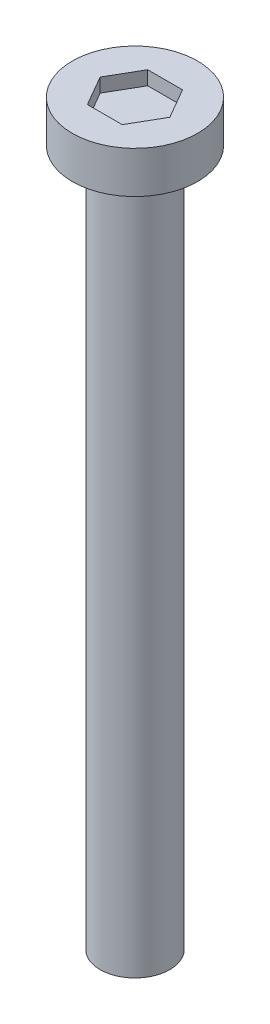
ISO-10303-21;
HEADER;
FILE_DESCRIPTION(('STEP AP214'),'2;1');
FILE_NAME('part.step','',(''),(''),'','','');
FILE_SCHEMA(('AUTOMOTIVE_DESIGN { 1 0 10303 214 1 1 1 1 }'));
ENDSEC;
DATA;
#1=APPLICATION_CONTEXT('core data for automotive mechanical design processes');
#2=APPLICATION_PROTOCOL_DEFINITION('international standard','automotive_design',2000,#1);
#3=PRODUCT_CONTEXT('',#1,'mechanical');
#4=PRODUCT('Part','Part','',(#3));
#5=PRODUCT_RELATED_PRODUCT_CATEGORY('part','',(#4));
#6=PRODUCT_DEFINITION_FORMATION('','',#4);
#7=PRODUCT_DEFINITION_CONTEXT('part definition',#1,'design');
#8=PRODUCT_DEFINITION('design','',#6,#7);
#9=PRODUCT_DEFINITION_SHAPE('','',#8);
#10=(LENGTH_UNIT() NAMED_UNIT(*) SI_UNIT(.MILLI.,.METRE.));
#11=(NAMED_UNIT(*) PLANE_ANGLE_UNIT() SI_UNIT($,.RADIAN.));
#12=(NAMED_UNIT(*) SI_UNIT($,.STERADIAN.) SOLID_ANGLE_UNIT());
#13=UNCERTAINTY_MEASURE_WITH_UNIT(LENGTH_MEASURE(1.E-05),#10,'distance_accuracy_value','');
#14=(GEOMETRIC_REPRESENTATION_CONTEXT(3) GLOBAL_UNCERTAINTY_ASSIGNED_CONTEXT((#13)) GLOBAL_UNIT_ASSIGNED_CONTEXT((#10,
#11,#12)) REPRESENTATION_CONTEXT('',''));
#15=CARTESIAN_POINT('',(0.,0.,0.));
#16=DIRECTION('',(0.,0.,1.));
#17=DIRECTION('',(1.,0.,0.));
#18=AXIS2_PLACEMENT_3D('',#15,#16,#17);
#19=CARTESIAN_POINT('',(0.,25.,0.));
#20=DIRECTION('',(0.,-1.,0.));
#21=DIRECTION('',(0.,0.,-1.));
#22=AXIS2_PLACEMENT_3D('',#19,#20,#21);
#23=CYLINDRICAL_SURFACE('',#22,1.25);
#24=CARTESIAN_POINT('',(0.,25.,0.));
#25=DIRECTION('',(0.,1.,0.));
#26=DIRECTION('',(0.,0.,1.));
#27=AXIS2_PLACEMENT_3D('',#24,#25,#26);
#28=CIRCLE('',#27,1.25);
#29=CARTESIAN_POINT('',(0.,25.,1.25));
#30=VERTEX_POINT('',#29);
#31=EDGE_CURVE('E11',#30,#30,#28,.T.);
#32=ORIENTED_EDGE('',*,*,#31,.F.);
#33=EDGE_LOOP('',(#32));
#34=FACE_BOUND('',#33,.T.);
#35=CARTESIAN_POINT('',(0.,0.,0.));
#36=DIRECTION('',(0.,1.,0.));
#37=DIRECTION('',(0.,0.,1.));
#38=AXIS2_PLACEMENT_3D('',#35,#36,#37);
#39=CIRCLE('',#38,1.25);
#40=CARTESIAN_POINT('',(0.,0.,1.25));
#41=VERTEX_POINT('',#40);
#42=EDGE_CURVE('E42',#41,#41,#39,.T.);
#43=ORIENTED_EDGE('',*,*,#42,.T.);
#44=EDGE_LOOP('',(#43));
#45=FACE_BOUND('',#44,.T.);
#46=ADVANCED_FACE('F39',(#34,#45),#23,.T.);
#47=CARTESIAN_POINT('',(0.,0.,0.));
#48=DIRECTION('',(0.,1.,0.));
#49=DIRECTION('',(0.,0.,1.));
#50=AXIS2_PLACEMENT_3D('',#47,#48,#49);
#51=PLANE('',#50);
#52=ORIENTED_EDGE('',*,*,#42,.F.);
#53=EDGE_LOOP('',(#52));
#54=FACE_BOUND('',#53,.T.);
#55=ADVANCED_FACE('F189',(#54),#51,.F.);
#56=CARTESIAN_POINT('',(0.,26.5,0.));
#57=DIRECTION('',(0.,-1.,0.));
#58=DIRECTION('',(0.,0.,-1.));
#59=AXIS2_PLACEMENT_3D('',#56,#57,#58);
#60=CYLINDRICAL_SURFACE('',#59,2.25);
#61=CARTESIAN_POINT('',(0.,26.5,0.));
#62=DIRECTION('',(0.,1.,0.));
#63=DIRECTION('',(0.,0.,1.));
#64=AXIS2_PLACEMENT_3D('',#61,#62,#63);
#65=CIRCLE('',#64,2.25);
#66=CARTESIAN_POINT('',(0.,26.5,2.25));
#67=VERTEX_POINT('',#66);
#68=EDGE_CURVE('E163',#67,#67,#65,.T.);
#69=ORIENTED_EDGE('',*,*,#68,.F.);
#70=EDGE_LOOP('',(#69));
#71=FACE_BOUND('',#70,.T.);
#72=CARTESIAN_POINT('',(0.,25.,0.));
#73=DIRECTION('',(0.,1.,0.));
#74=DIRECTION('',(0.,0.,1.));
#75=AXIS2_PLACEMENT_3D('',#72,#73,#74);
#76=CIRCLE('',#75,2.25);
#77=CARTESIAN_POINT('',(0.,25.,2.25));
#78=VERTEX_POINT('',#77);
#79=EDGE_CURVE('E153',#78,#78,#76,.T.);
#80=ORIENTED_EDGE('',*,*,#79,.T.);
#81=EDGE_LOOP('',(#80));
#82=FACE_BOUND('',#81,.T.);
#83=ADVANCED_FACE('F171',(#71,#82),#60,.T.);
#84=CARTESIAN_POINT('',(0.,26.5,0.));
#85=DIRECTION('',(0.,1.,0.));
#86=DIRECTION('',(0.,0.,1.));
#87=AXIS2_PLACEMENT_3D('',#84,#85,#86);
#88=PLANE('',#87);
#89=DIRECTION('',(0.5,0.,-0.866025403784439));
#90=VECTOR('',#89,1.);
#91=CARTESIAN_POINT('',(0.625,26.5,1.08253175473055));
#92=LINE('',#91,#90);
#93=CARTESIAN_POINT('',(0.625,26.5,1.08253175473055));
#94=VERTEX_POINT('',#93);
#95=CARTESIAN_POINT('',(1.25,26.5,0.));
#96=VERTEX_POINT('',#95);
#97=EDGE_CURVE('E54',#94,#96,#92,.T.);
#98=ORIENTED_EDGE('',*,*,#97,.F.);
#99=DIRECTION('',(1.,0.,0.));
#100=VECTOR('',#99,1.);
#101=CARTESIAN_POINT('',(-0.625,26.5,1.08253175473055));
#102=LINE('',#101,#100);
#103=CARTESIAN_POINT('',(-0.625,26.5,1.08253175473055));
#104=VERTEX_POINT('',#103);
#105=EDGE_CURVE('E147',#104,#94,#102,.T.);
#106=ORIENTED_EDGE('',*,*,#105,.F.);
#107=DIRECTION('',(0.5,0.,0.866025403784439));
#108=VECTOR('',#107,1.);
#109=CARTESIAN_POINT('',(-1.25,26.5,0.));
#110=LINE('',#109,#108);
#111=CARTESIAN_POINT('',(-1.25,26.5,0.));
#112=VERTEX_POINT('',#111);
#113=EDGE_CURVE('E144',#112,#104,#110,.T.);
#114=ORIENTED_EDGE('',*,*,#113,.F.);
#115=DIRECTION('',(-0.5,0.,0.866025403784439));
#116=VECTOR('',#115,1.);
#117=CARTESIAN_POINT('',(-0.625,26.5,-1.08253175473055));
#118=LINE('',#117,#116);
#119=CARTESIAN_POINT('',(-0.625,26.5,-1.08253175473055));
#120=VERTEX_POINT('',#119);
#121=EDGE_CURVE('E102',#120,#112,#118,.T.);
#122=ORIENTED_EDGE('',*,*,#121,.F.);
#123=DIRECTION('',(-1.,0.,0.));
#124=VECTOR('',#123,1.);
#125=CARTESIAN_POINT('',(0.625,26.5,-1.08253175473055));
#126=LINE('',#125,#124);
#127=CARTESIAN_POINT('',(0.625,26.5,-1.08253175473055));
#128=VERTEX_POINT('',#127);
#129=EDGE_CURVE('E138',#128,#120,#126,.T.);
#130=ORIENTED_EDGE('',*,*,#129,.F.);
#131=DIRECTION('',(-0.5,0.,-0.866025403784439));
#132=VECTOR('',#131,1.);
#133=CARTESIAN_POINT('',(1.25,26.5,0.));
#134=LINE('',#133,#132);
#135=EDGE_CURVE('E134',#96,#128,#134,.T.);
#136=ORIENTED_EDGE('',*,*,#135,.F.);
#137=EDGE_LOOP('',(#98,#106,#114,#122,#130,#136));
#138=FACE_BOUND('',#137,.T.);
#139=ORIENTED_EDGE('',*,*,#68,.T.);
#140=EDGE_LOOP('',(#139));
#141=FACE_BOUND('',#140,.T.);
#142=ADVANCED_FACE('F176',(#138,#141),#88,.T.);
#143=CARTESIAN_POINT('',(0.,25.,0.));
#144=DIRECTION('',(0.,1.,0.));
#145=DIRECTION('',(0.,0.,1.));
#146=AXIS2_PLACEMENT_3D('',#143,#144,#145);
#147=PLANE('',#146);
#148=ORIENTED_EDGE('',*,*,#31,.T.);
#149=EDGE_LOOP('',(#148));
#150=FACE_BOUND('',#149,.T.);
#151=ORIENTED_EDGE('',*,*,#79,.F.);
#152=EDGE_LOOP('',(#151));
#153=FACE_BOUND('',#152,.T.);
#154=ADVANCED_FACE('F173',(#150,#153),#147,.F.);
#155=CARTESIAN_POINT('',(0.625,26.,1.08253175473055));
#156=DIRECTION('',(0.866025403784439,0.,0.5));
#157=DIRECTION('',(0.5,0.,-0.866025403784439));
#158=AXIS2_PLACEMENT_3D('',#155,#156,#157);
#159=PLANE('',#158);
#160=ORIENTED_EDGE('',*,*,#97,.T.);
#161=DIRECTION('',(0.,1.,0.));
#162=VECTOR('',#161,1.);
#163=CARTESIAN_POINT('',(1.25,26.,0.));
#164=LINE('',#163,#162);
#165=CARTESIAN_POINT('',(1.25,26.,0.));
#166=VERTEX_POINT('',#165);
#167=EDGE_CURVE('E84',#166,#96,#164,.T.);
#168=ORIENTED_EDGE('',*,*,#167,.F.);
#169=DIRECTION('',(0.5,0.,-0.866025403784439));
#170=VECTOR('',#169,1.);
#171=CARTESIAN_POINT('',(0.625,26.,1.08253175473055));
#172=LINE('',#171,#170);
#173=CARTESIAN_POINT('',(0.625,26.,1.08253175473055));
#174=VERTEX_POINT('',#173);
#175=EDGE_CURVE('E150',#174,#166,#172,.T.);
#176=ORIENTED_EDGE('',*,*,#175,.F.);
#177=DIRECTION('',(0.,1.,0.));
#178=VECTOR('',#177,1.);
#179=CARTESIAN_POINT('',(0.625,26.,1.08253175473055));
#180=LINE('',#179,#178);
#181=EDGE_CURVE('E62',#174,#94,#180,.T.);
#182=ORIENTED_EDGE('',*,*,#181,.T.);
#183=EDGE_LOOP('',(#160,#168,#176,#182));
#184=FACE_BOUND('',#183,.T.);
#185=ADVANCED_FACE('F175',(#184),#159,.F.);
#186=CARTESIAN_POINT('',(-0.625,26.,1.08253175473055));
#187=DIRECTION('',(0.,0.,1.));
#188=DIRECTION('',(1.,0.,0.));
#189=AXIS2_PLACEMENT_3D('',#186,#187,#188);
#190=PLANE('',#189);
#191=ORIENTED_EDGE('',*,*,#105,.T.);
#192=ORIENTED_EDGE('',*,*,#181,.F.);
#193=DIRECTION('',(1.,0.,0.));
#194=VECTOR('',#193,1.);
#195=CARTESIAN_POINT('',(-0.625,26.,1.08253175473055));
#196=LINE('',#195,#194);
#197=CARTESIAN_POINT('',(-0.625,26.,1.08253175473055));
#198=VERTEX_POINT('',#197);
#199=EDGE_CURVE('E116',#198,#174,#196,.T.);
#200=ORIENTED_EDGE('',*,*,#199,.F.);
#201=DIRECTION('',(0.,1.,0.));
#202=VECTOR('',#201,1.);
#203=CARTESIAN_POINT('',(-0.625,26.,1.08253175473055));
#204=LINE('',#203,#202);
#205=EDGE_CURVE('E107',#198,#104,#204,.T.);
#206=ORIENTED_EDGE('',*,*,#205,.T.);
#207=EDGE_LOOP('',(#191,#192,#200,#206));
#208=FACE_BOUND('',#207,.T.);
#209=ADVANCED_FACE('F183',(#208),#190,.F.);
#210=CARTESIAN_POINT('',(-1.25,26.,0.));
#211=DIRECTION('',(-0.866025403784439,0.,0.5));
#212=DIRECTION('',(0.5,0.,0.866025403784439));
#213=AXIS2_PLACEMENT_3D('',#210,#211,#212);
#214=PLANE('',#213);
#215=ORIENTED_EDGE('',*,*,#113,.T.);
#216=ORIENTED_EDGE('',*,*,#205,.F.);
#217=DIRECTION('',(0.5,0.,0.866025403784439));
#218=VECTOR('',#217,1.);
#219=CARTESIAN_POINT('',(-1.25,26.,0.));
#220=LINE('',#219,#218);
#221=CARTESIAN_POINT('',(-1.25,26.,0.));
#222=VERTEX_POINT('',#221);
#223=EDGE_CURVE('E111',#222,#198,#220,.T.);
#224=ORIENTED_EDGE('',*,*,#223,.F.);
#225=DIRECTION('',(0.,1.,0.));
#226=VECTOR('',#225,1.);
#227=CARTESIAN_POINT('',(-1.25,26.,0.));
#228=LINE('',#227,#226);
#229=EDGE_CURVE('E95',#222,#112,#228,.T.);
#230=ORIENTED_EDGE('',*,*,#229,.T.);
#231=EDGE_LOOP('',(#215,#216,#224,#230));
#232=FACE_BOUND('',#231,.T.);
#233=ADVANCED_FACE('F112',(#232),#214,.F.);
#234=CARTESIAN_POINT('',(-0.625,26.,-1.08253175473055));
#235=DIRECTION('',(-0.866025403784439,0.,-0.5));
#236=DIRECTION('',(-0.5,0.,0.866025403784439));
#237=AXIS2_PLACEMENT_3D('',#234,#235,#236);
#238=PLANE('',#237);
#239=ORIENTED_EDGE('',*,*,#121,.T.);
#240=ORIENTED_EDGE('',*,*,#229,.F.);
#241=DIRECTION('',(-0.5,0.,0.866025403784439));
#242=VECTOR('',#241,1.);
#243=CARTESIAN_POINT('',(-0.625,26.,-1.08253175473055));
#244=LINE('',#243,#242);
#245=CARTESIAN_POINT('',(-0.625,26.,-1.08253175473055));
#246=VERTEX_POINT('',#245);
#247=EDGE_CURVE('E99',#246,#222,#244,.T.);
#248=ORIENTED_EDGE('',*,*,#247,.F.);
#249=DIRECTION('',(0.,1.,0.));
#250=VECTOR('',#249,1.);
#251=CARTESIAN_POINT('',(-0.625,26.,-1.08253175473055));
#252=LINE('',#251,#250);
#253=EDGE_CURVE('E108',#246,#120,#252,.T.);
#254=ORIENTED_EDGE('',*,*,#253,.T.);
#255=EDGE_LOOP('',(#239,#240,#248,#254));
#256=FACE_BOUND('',#255,.T.);
#257=ADVANCED_FACE('F97',(#256),#238,.F.);
#258=CARTESIAN_POINT('',(0.625,26.,-1.08253175473055));
#259=DIRECTION('',(0.,0.,-1.));
#260=DIRECTION('',(-1.,0.,0.));
#261=AXIS2_PLACEMENT_3D('',#258,#259,#260);
#262=PLANE('',#261);
#263=ORIENTED_EDGE('',*,*,#129,.T.);
#264=ORIENTED_EDGE('',*,*,#253,.F.);
#265=DIRECTION('',(-1.,0.,0.));
#266=VECTOR('',#265,1.);
#267=CARTESIAN_POINT('',(0.625,26.,-1.08253175473055));
#268=LINE('',#267,#266);
#269=CARTESIAN_POINT('',(0.625,26.,-1.08253175473055));
#270=VERTEX_POINT('',#269);
#271=EDGE_CURVE('E122',#270,#246,#268,.T.);
#272=ORIENTED_EDGE('',*,*,#271,.F.);
#273=DIRECTION('',(0.,1.,0.));
#274=VECTOR('',#273,1.);
#275=CARTESIAN_POINT('',(0.625,26.,-1.08253175473055));
#276=LINE('',#275,#274);
#277=EDGE_CURVE('E158',#270,#128,#276,.T.);
#278=ORIENTED_EDGE('',*,*,#277,.T.);
#279=EDGE_LOOP('',(#263,#264,#272,#278));
#280=FACE_BOUND('',#279,.T.);
#281=ADVANCED_FACE('F245',(#280),#262,.F.);
#282=CARTESIAN_POINT('',(1.25,26.,0.));
#283=DIRECTION('',(0.866025403784439,0.,-0.5));
#284=DIRECTION('',(-0.5,0.,-0.866025403784439));
#285=AXIS2_PLACEMENT_3D('',#282,#283,#284);
#286=PLANE('',#285);
#287=ORIENTED_EDGE('',*,*,#135,.T.);
#288=ORIENTED_EDGE('',*,*,#277,.F.);
#289=DIRECTION('',(-0.5,0.,-0.866025403784439));
#290=VECTOR('',#289,1.);
#291=CARTESIAN_POINT('',(1.25,26.,0.));
#292=LINE('',#291,#290);
#293=EDGE_CURVE('E126',#166,#270,#292,.T.);
#294=ORIENTED_EDGE('',*,*,#293,.F.);
#295=ORIENTED_EDGE('',*,*,#167,.T.);
#296=EDGE_LOOP('',(#287,#288,#294,#295));
#297=FACE_BOUND('',#296,.T.);
#298=ADVANCED_FACE('F254',(#297),#286,.F.);
#299=CARTESIAN_POINT('',(0.,26.,0.));
#300=DIRECTION('',(0.,1.,0.));
#301=DIRECTION('',(0.,0.,1.));
#302=AXIS2_PLACEMENT_3D('',#299,#300,#301);
#303=PLANE('',#302);
#304=ORIENTED_EDGE('',*,*,#175,.T.);
#305=ORIENTED_EDGE('',*,*,#293,.T.);
#306=ORIENTED_EDGE('',*,*,#271,.T.);
#307=ORIENTED_EDGE('',*,*,#247,.T.);
#308=ORIENTED_EDGE('',*,*,#223,.T.);
#309=ORIENTED_EDGE('',*,*,#199,.T.);
#310=EDGE_LOOP('',(#304,#305,#306,#307,#308,#309));
#311=FACE_BOUND('',#310,.T.);
#312=ADVANCED_FACE('F119',(#311),#303,.T.);
#313=CLOSED_SHELL('',(#46,#55,#83,#142,#154,#185,#209,#233,#257,#281,#298,#312));
#314=MANIFOLD_SOLID_BREP('B2',#313);
#315=ADVANCED_BREP_SHAPE_REPRESENTATION('',(#18,#314),#14);
#316=SHAPE_DEFINITION_REPRESENTATION(#9,#315);
ENDSEC;
END-ISO-10303-21;
